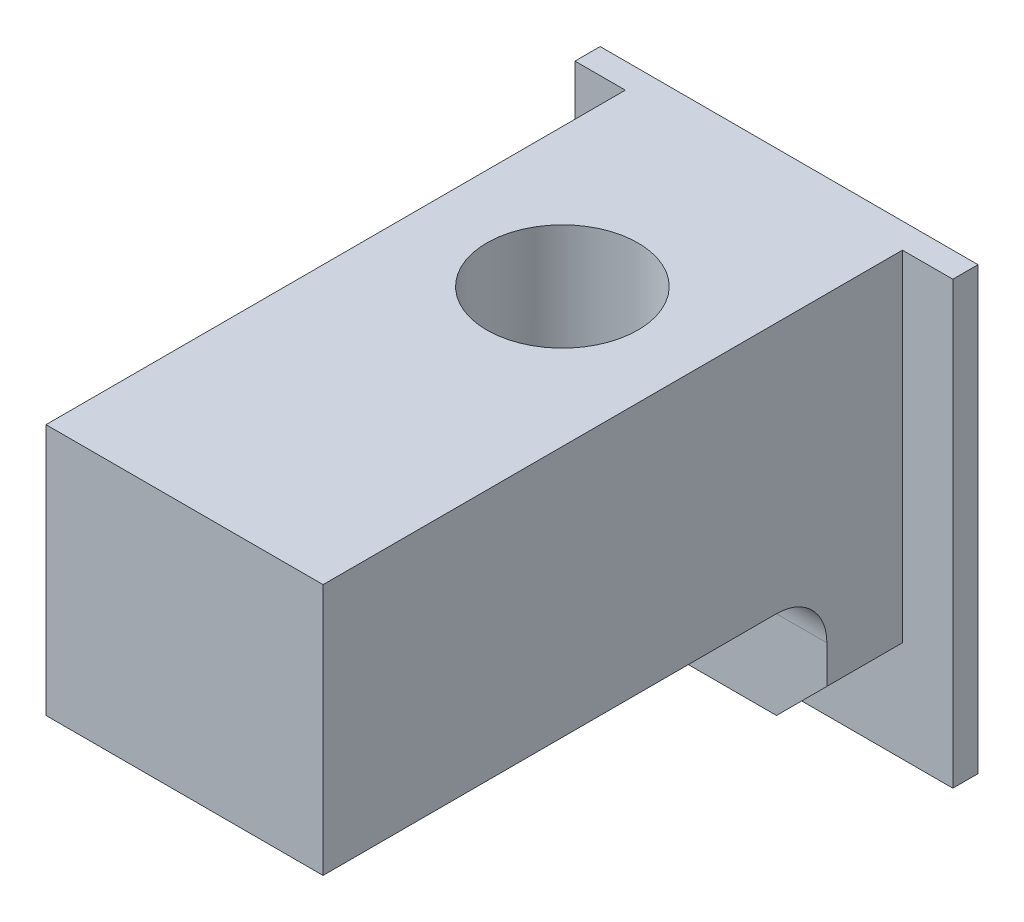
ISO-10303-21;
HEADER;
FILE_DESCRIPTION(('STEP AP214'),'2;1');
FILE_NAME('part.step','',(''),(''),'','','');
FILE_SCHEMA(('AUTOMOTIVE_DESIGN { 1 0 10303 214 1 1 1 1 }'));
ENDSEC;
DATA;
#1=APPLICATION_CONTEXT('core data for automotive mechanical design processes');
#2=APPLICATION_PROTOCOL_DEFINITION('international standard','automotive_design',2000,#1);
#3=PRODUCT_CONTEXT('',#1,'mechanical');
#4=PRODUCT('Part','Part','',(#3));
#5=PRODUCT_RELATED_PRODUCT_CATEGORY('part','',(#4));
#6=PRODUCT_DEFINITION_FORMATION('','',#4);
#7=PRODUCT_DEFINITION_CONTEXT('part definition',#1,'design');
#8=PRODUCT_DEFINITION('design','',#6,#7);
#9=PRODUCT_DEFINITION_SHAPE('','',#8);
#10=(LENGTH_UNIT() NAMED_UNIT(*) SI_UNIT(.MILLI.,.METRE.));
#11=(NAMED_UNIT(*) PLANE_ANGLE_UNIT() SI_UNIT($,.RADIAN.));
#12=(NAMED_UNIT(*) SI_UNIT($,.STERADIAN.) SOLID_ANGLE_UNIT());
#13=UNCERTAINTY_MEASURE_WITH_UNIT(LENGTH_MEASURE(1.E-05),#10,'distance_accuracy_value','');
#14=(GEOMETRIC_REPRESENTATION_CONTEXT(3) GLOBAL_UNCERTAINTY_ASSIGNED_CONTEXT((#13)) GLOBAL_UNIT_ASSIGNED_CONTEXT((#10,
#11,#12)) REPRESENTATION_CONTEXT('',''));
#15=CARTESIAN_POINT('',(0.,0.,0.));
#16=DIRECTION('',(0.,0.,1.));
#17=DIRECTION('',(1.,0.,0.));
#18=AXIS2_PLACEMENT_3D('',#15,#16,#17);
#19=CARTESIAN_POINT('',(2.75000000000002,-2.5,4.99999999999998));
#20=DIRECTION('',(0.,1.,0.));
#21=DIRECTION('',(-1.,0.,0.));
#22=AXIS2_PLACEMENT_3D('',#19,#20,#21);
#23=PLANE('',#22);
#24=DIRECTION('',(0.,0.,-1.));
#25=VECTOR('',#24,1.);
#26=CARTESIAN_POINT('',(-2.74999999999998,-2.5,5.00000000000003));
#27=LINE('',#26,#25);
#28=CARTESIAN_POINT('',(-2.74999999999998,-2.5,5.00000000000003));
#29=VERTEX_POINT('',#28);
#30=CARTESIAN_POINT('',(-2.75000000000001,-2.5,-4.00000000000006));
#31=VERTEX_POINT('',#30);
#32=EDGE_CURVE('E285',#29,#31,#27,.T.);
#33=ORIENTED_EDGE('',*,*,#32,.T.);
#34=DIRECTION('',(1.,0.,0.));
#35=VECTOR('',#34,1.);
#36=CARTESIAN_POINT('',(2.75000000000005,-2.5,-4.00000000000003));
#37=LINE('',#36,#35);
#38=CARTESIAN_POINT('',(0.,-2.5,-4.));
#39=VERTEX_POINT('',#38);
#40=EDGE_CURVE('E251',#31,#39,#37,.T.);
#41=ORIENTED_EDGE('',*,*,#40,.T.);
#42=CARTESIAN_POINT('',(0.,-2.5,-2.50000000000003));
#43=DIRECTION('',(0.,1.,0.));
#44=DIRECTION('',(0.,0.,1.));
#45=AXIS2_PLACEMENT_3D('',#42,#43,#44);
#46=CIRCLE('',#45,1.5);
#47=EDGE_CURVE('E269',#39,#39,#46,.T.);
#48=ORIENTED_EDGE('',*,*,#47,.T.);
#49=DIRECTION('',(1.,0.,0.));
#50=VECTOR('',#49,1.);
#51=CARTESIAN_POINT('',(2.75000000000005,-2.5,-4.00000000000003));
#52=LINE('',#51,#50);
#53=CARTESIAN_POINT('',(2.75000000000005,-2.5,-4.00000000000003));
#54=VERTEX_POINT('',#53);
#55=EDGE_CURVE('E248',#39,#54,#52,.T.);
#56=ORIENTED_EDGE('',*,*,#55,.T.);
#57=DIRECTION('',(0.,0.,-1.));
#58=VECTOR('',#57,1.);
#59=CARTESIAN_POINT('',(2.75000000000002,-2.5,4.99999999999998));
#60=LINE('',#59,#58);
#61=CARTESIAN_POINT('',(2.75000000000002,-2.5,4.99999999999998));
#62=VERTEX_POINT('',#61);
#63=EDGE_CURVE('E286',#62,#54,#60,.T.);
#64=ORIENTED_EDGE('',*,*,#63,.F.);
#65=DIRECTION('',(1.,0.,0.));
#66=VECTOR('',#65,1.);
#67=CARTESIAN_POINT('',(2.75000000000002,-2.5,4.99999999999998));
#68=LINE('',#67,#66);
#69=EDGE_CURVE('E276',#29,#62,#68,.T.);
#70=ORIENTED_EDGE('',*,*,#69,.F.);
#71=EDGE_LOOP('',(#33,#41,#48,#56,#64,#70));
#72=FACE_BOUND('',#71,.T.);
#73=ADVANCED_FACE('F46',(#72),#23,.F.);
#74=CARTESIAN_POINT('',(2.75000000000002,2.5,4.99999999999998));
#75=DIRECTION('',(-1.,0.,0.));
#76=DIRECTION('',(0.,-1.,0.));
#77=AXIS2_PLACEMENT_3D('',#74,#75,#76);
#78=PLANE('',#77);
#79=ORIENTED_EDGE('',*,*,#63,.T.);
#80=CARTESIAN_POINT('',(2.75000000000005,-3.5,-4.00000000000003));
#81=DIRECTION('',(-1.,0.,0.));
#82=DIRECTION('',(0.,-1.,0.));
#83=AXIS2_PLACEMENT_3D('',#80,#81,#82);
#84=CIRCLE('',#83,1.);
#85=CARTESIAN_POINT('',(2.74999999999999,-3.5,-5.00000000000003));
#86=VERTEX_POINT('',#85);
#87=EDGE_CURVE('E54',#54,#86,#84,.T.);
#88=ORIENTED_EDGE('',*,*,#87,.T.);
#89=DIRECTION('',(0.,-1.,0.));
#90=VECTOR('',#89,1.);
#91=CARTESIAN_POINT('',(2.74999999999999,2.5,-5.00000000000003));
#92=LINE('',#91,#90);
#93=CARTESIAN_POINT('',(2.74999999999999,-4.25,-5.00000000000003));
#94=VERTEX_POINT('',#93);
#95=EDGE_CURVE('E172',#86,#94,#92,.T.);
#96=ORIENTED_EDGE('',*,*,#95,.T.);
#97=DIRECTION('',(0.,0.,-1.));
#98=VECTOR('',#97,1.);
#99=CARTESIAN_POINT('',(2.75000000000002,-4.25,4.99999999999998));
#100=LINE('',#99,#98);
#101=CARTESIAN_POINT('',(2.75000000000001,-4.25,-6.50000000000009));
#102=VERTEX_POINT('',#101);
#103=EDGE_CURVE('E243',#94,#102,#100,.T.);
#104=ORIENTED_EDGE('',*,*,#103,.T.);
#105=DIRECTION('',(0.,-1.,0.));
#106=VECTOR('',#105,1.);
#107=CARTESIAN_POINT('',(2.75000000000002,2.5,-6.50000000000003));
#108=LINE('',#107,#106);
#109=CARTESIAN_POINT('',(2.75000000000002,2.5,-6.50000000000003));
#110=VERTEX_POINT('',#109);
#111=EDGE_CURVE('E298',#110,#102,#108,.T.);
#112=ORIENTED_EDGE('',*,*,#111,.F.);
#113=DIRECTION('',(0.,0.,-1.));
#114=VECTOR('',#113,1.);
#115=CARTESIAN_POINT('',(2.75000000000002,2.5,4.99999999999998));
#116=LINE('',#115,#114);
#117=CARTESIAN_POINT('',(2.75000000000002,2.5,4.99999999999998));
#118=VERTEX_POINT('',#117);
#119=EDGE_CURVE('E205',#118,#110,#116,.T.);
#120=ORIENTED_EDGE('',*,*,#119,.F.);
#121=DIRECTION('',(0.,1.,0.));
#122=VECTOR('',#121,1.);
#123=CARTESIAN_POINT('',(2.75000000000002,2.5,4.99999999999998));
#124=LINE('',#123,#122);
#125=EDGE_CURVE('E279',#62,#118,#124,.T.);
#126=ORIENTED_EDGE('',*,*,#125,.F.);
#127=EDGE_LOOP('',(#79,#88,#96,#104,#112,#120,#126));
#128=FACE_BOUND('',#127,.T.);
#129=ADVANCED_FACE('F219',(#128),#78,.F.);
#130=CARTESIAN_POINT('',(-2.74999999999998,2.5,5.00000000000003));
#131=DIRECTION('',(0.,-1.,0.));
#132=DIRECTION('',(0.,0.,-1.));
#133=AXIS2_PLACEMENT_3D('',#130,#131,#132);
#134=PLANE('',#133);
#135=CARTESIAN_POINT('',(0.,2.5,-2.50000000000003));
#136=DIRECTION('',(0.,1.,0.));
#137=DIRECTION('',(0.,0.,1.));
#138=AXIS2_PLACEMENT_3D('',#135,#136,#137);
#139=CIRCLE('',#138,1.5);
#140=CARTESIAN_POINT('',(0.,2.5,-1.00000000000003));
#141=VERTEX_POINT('',#140);
#142=EDGE_CURVE('E272',#141,#141,#139,.T.);
#143=ORIENTED_EDGE('',*,*,#142,.F.);
#144=EDGE_LOOP('',(#143));
#145=FACE_BOUND('',#144,.T.);
#146=ORIENTED_EDGE('',*,*,#119,.T.);
#147=DIRECTION('',(1.,0.,0.));
#148=VECTOR('',#147,1.);
#149=CARTESIAN_POINT('',(-3.75,2.5,-6.50000000000001));
#150=LINE('',#149,#148);
#151=CARTESIAN_POINT('',(3.75000000000002,2.5,-6.50000000000009));
#152=VERTEX_POINT('',#151);
#153=EDGE_CURVE('E182',#110,#152,#150,.T.);
#154=ORIENTED_EDGE('',*,*,#153,.T.);
#155=DIRECTION('',(0.,0.,1.));
#156=VECTOR('',#155,1.);
#157=CARTESIAN_POINT('',(3.74999999999997,2.5,-7.00000000000001));
#158=LINE('',#157,#156);
#159=CARTESIAN_POINT('',(3.74999999999997,2.5,-7.00000000000001));
#160=VERTEX_POINT('',#159);
#161=EDGE_CURVE('E152',#160,#152,#158,.T.);
#162=ORIENTED_EDGE('',*,*,#161,.F.);
#163=DIRECTION('',(1.,0.,0.));
#164=VECTOR('',#163,1.);
#165=CARTESIAN_POINT('',(-3.75000000000001,2.5,-6.99999999999998));
#166=LINE('',#165,#164);
#167=CARTESIAN_POINT('',(-3.75000000000001,2.5,-6.99999999999998));
#168=VERTEX_POINT('',#167);
#169=EDGE_CURVE('E144',#168,#160,#166,.T.);
#170=ORIENTED_EDGE('',*,*,#169,.F.);
#171=DIRECTION('',(0.,0.,1.));
#172=VECTOR('',#171,1.);
#173=CARTESIAN_POINT('',(-3.75000000000001,2.5,-6.99999999999998));
#174=LINE('',#173,#172);
#175=CARTESIAN_POINT('',(-3.75,2.5,-6.50000000000001));
#176=VERTEX_POINT('',#175);
#177=EDGE_CURVE('E149',#168,#176,#174,.T.);
#178=ORIENTED_EDGE('',*,*,#177,.T.);
#179=CARTESIAN_POINT('',(-2.75,2.5,-6.50000000000009));
#180=VERTEX_POINT('',#179);
#181=EDGE_CURVE('E178',#176,#180,#150,.T.);
#182=ORIENTED_EDGE('',*,*,#181,.T.);
#183=DIRECTION('',(0.,0.,-1.));
#184=VECTOR('',#183,1.);
#185=CARTESIAN_POINT('',(-2.74999999999998,2.5,5.00000000000003));
#186=LINE('',#185,#184);
#187=CARTESIAN_POINT('',(-2.74999999999998,2.5,5.00000000000003));
#188=VERTEX_POINT('',#187);
#189=EDGE_CURVE('E292',#188,#180,#186,.T.);
#190=ORIENTED_EDGE('',*,*,#189,.F.);
#191=DIRECTION('',(-1.,0.,0.));
#192=VECTOR('',#191,1.);
#193=CARTESIAN_POINT('',(-2.74999999999998,2.5,5.00000000000003));
#194=LINE('',#193,#192);
#195=EDGE_CURVE('E281',#118,#188,#194,.T.);
#196=ORIENTED_EDGE('',*,*,#195,.F.);
#197=EDGE_LOOP('',(#146,#154,#162,#170,#178,#182,#190,#196));
#198=FACE_BOUND('',#197,.T.);
#199=ADVANCED_FACE('F146',(#145,#198),#134,.F.);
#200=CARTESIAN_POINT('',(-2.74999999999998,-2.5,5.00000000000003));
#201=DIRECTION('',(1.,0.,0.));
#202=DIRECTION('',(0.,1.,0.));
#203=AXIS2_PLACEMENT_3D('',#200,#201,#202);
#204=PLANE('',#203);
#205=DIRECTION('',(0.,1.,0.));
#206=VECTOR('',#205,1.);
#207=CARTESIAN_POINT('',(-2.75,2.5,-6.50000000000009));
#208=LINE('',#207,#206);
#209=CARTESIAN_POINT('',(-2.75,-4.25,-6.50000000000009));
#210=VERTEX_POINT('',#209);
#211=EDGE_CURVE('E268',#210,#180,#208,.T.);
#212=ORIENTED_EDGE('',*,*,#211,.F.);
#213=DIRECTION('',(0.,0.,1.));
#214=VECTOR('',#213,1.);
#215=CARTESIAN_POINT('',(-2.74999999999998,-4.25,5.00000000000003));
#216=LINE('',#215,#214);
#217=CARTESIAN_POINT('',(-2.75000000000004,-4.25,-5.00000000000009));
#218=VERTEX_POINT('',#217);
#219=EDGE_CURVE('E288',#210,#218,#216,.T.);
#220=ORIENTED_EDGE('',*,*,#219,.T.);
#221=DIRECTION('',(0.,1.,0.));
#222=VECTOR('',#221,1.);
#223=CARTESIAN_POINT('',(-2.75000000000003,2.5,-5.00000000000006));
#224=LINE('',#223,#222);
#225=CARTESIAN_POINT('',(-2.75000000000004,-3.5,-5.00000000000009));
#226=VERTEX_POINT('',#225);
#227=EDGE_CURVE('E170',#218,#226,#224,.T.);
#228=ORIENTED_EDGE('',*,*,#227,.T.);
#229=CARTESIAN_POINT('',(-2.75000000000001,-3.5,-4.00000000000006));
#230=DIRECTION('',(1.,0.,0.));
#231=DIRECTION('',(0.,1.,0.));
#232=AXIS2_PLACEMENT_3D('',#229,#230,#231);
#233=CIRCLE('',#232,1.);
#234=EDGE_CURVE('E12',#226,#31,#233,.T.);
#235=ORIENTED_EDGE('',*,*,#234,.T.);
#236=ORIENTED_EDGE('',*,*,#32,.F.);
#237=DIRECTION('',(0.,-1.,0.));
#238=VECTOR('',#237,1.);
#239=CARTESIAN_POINT('',(-2.74999999999998,-2.5,5.00000000000003));
#240=LINE('',#239,#238);
#241=EDGE_CURVE('E283',#188,#29,#240,.T.);
#242=ORIENTED_EDGE('',*,*,#241,.F.);
#243=ORIENTED_EDGE('',*,*,#189,.T.);
#244=EDGE_LOOP('',(#212,#220,#228,#235,#236,#242,#243));
#245=FACE_BOUND('',#244,.T.);
#246=ADVANCED_FACE('F339',(#245),#204,.F.);
#247=CARTESIAN_POINT('',(2.75000000000002,-2.5,4.99999999999998));
#248=DIRECTION('',(0.,0.,1.));
#249=DIRECTION('',(1.,0.,0.));
#250=AXIS2_PLACEMENT_3D('',#247,#248,#249);
#251=PLANE('',#250);
#252=ORIENTED_EDGE('',*,*,#69,.T.);
#253=ORIENTED_EDGE('',*,*,#125,.T.);
#254=ORIENTED_EDGE('',*,*,#195,.T.);
#255=ORIENTED_EDGE('',*,*,#241,.T.);
#256=EDGE_LOOP('',(#252,#253,#254,#255));
#257=FACE_BOUND('',#256,.T.);
#258=ADVANCED_FACE('F335',(#257),#251,.T.);
#259=CARTESIAN_POINT('',(0.,2.5,-2.50000000000003));
#260=DIRECTION('',(0.,1.,0.));
#261=DIRECTION('',(0.,0.,1.));
#262=AXIS2_PLACEMENT_3D('',#259,#260,#261);
#263=CYLINDRICAL_SURFACE('',#262,1.5);
#264=ORIENTED_EDGE('',*,*,#47,.F.);
#265=EDGE_LOOP('',(#264));
#266=FACE_BOUND('',#265,.T.);
#267=ORIENTED_EDGE('',*,*,#142,.T.);
#268=EDGE_LOOP('',(#267));
#269=FACE_BOUND('',#268,.T.);
#270=ADVANCED_FACE('F330',(#266,#269),#263,.F.);
#271=CARTESIAN_POINT('',(-2.75000000000004,-5.25,-5.00000000000009));
#272=DIRECTION('',(0.,0.,1.));
#273=DIRECTION('',(1.,0.,0.));
#274=AXIS2_PLACEMENT_3D('',#271,#272,#273);
#275=PLANE('',#274);
#276=ORIENTED_EDGE('',*,*,#95,.F.);
#277=DIRECTION('',(1.,0.,0.));
#278=VECTOR('',#277,1.);
#279=CARTESIAN_POINT('',(-2.75000000000004,-3.5,-5.00000000000009));
#280=LINE('',#279,#278);
#281=EDGE_CURVE('E67',#86,#226,#280,.F.);
#282=ORIENTED_EDGE('',*,*,#281,.T.);
#283=ORIENTED_EDGE('',*,*,#227,.F.);
#284=DIRECTION('',(-0.707106781186549,0.707106781186546,0.));
#285=VECTOR('',#284,1.);
#286=CARTESIAN_POINT('',(-2.25,-4.75,-5.00000000000003));
#287=LINE('',#286,#285);
#288=CARTESIAN_POINT('',(-1.75000000000001,-5.25,-5.));
#289=VERTEX_POINT('',#288);
#290=EDGE_CURVE('E315',#218,#289,#287,.F.);
#291=ORIENTED_EDGE('',*,*,#290,.T.);
#292=DIRECTION('',(-1.,0.,0.));
#293=VECTOR('',#292,1.);
#294=CARTESIAN_POINT('',(-2.75000000000004,-5.25,-5.00000000000009));
#295=LINE('',#294,#293);
#296=CARTESIAN_POINT('',(1.74999999999998,-5.25,-5.00000000000003));
#297=VERTEX_POINT('',#296);
#298=EDGE_CURVE('E260',#297,#289,#295,.T.);
#299=ORIENTED_EDGE('',*,*,#298,.F.);
#300=DIRECTION('',(-0.707106781186547,-0.707106781186549,0.));
#301=VECTOR('',#300,1.);
#302=CARTESIAN_POINT('',(-0.499999999999968,-7.50000000000001,-5.00000000000014));
#303=LINE('',#302,#301);
#304=EDGE_CURVE('E317',#297,#94,#303,.F.);
#305=ORIENTED_EDGE('',*,*,#304,.T.);
#306=EDGE_LOOP('',(#276,#282,#283,#291,#299,#305));
#307=FACE_BOUND('',#306,.T.);
#308=ADVANCED_FACE('F324',(#307),#275,.T.);
#309=CARTESIAN_POINT('',(-2.75,-5.25,-6.50000000000009));
#310=DIRECTION('',(0.,1.,0.));
#311=DIRECTION('',(-1.,0.,0.));
#312=AXIS2_PLACEMENT_3D('',#309,#310,#311);
#313=PLANE('',#312);
#314=ORIENTED_EDGE('',*,*,#298,.T.);
#315=DIRECTION('',(0.,0.,-1.));
#316=VECTOR('',#315,1.);
#317=CARTESIAN_POINT('',(-1.75000000000001,-5.25,-6.50000000000003));
#318=LINE('',#317,#316);
#319=CARTESIAN_POINT('',(-1.75000000000001,-5.25,-6.50000000000003));
#320=VERTEX_POINT('',#319);
#321=EDGE_CURVE('E313',#289,#320,#318,.T.);
#322=ORIENTED_EDGE('',*,*,#321,.T.);
#323=DIRECTION('',(-1.,0.,0.));
#324=VECTOR('',#323,1.);
#325=CARTESIAN_POINT('',(-2.75,-5.25,-6.50000000000009));
#326=LINE('',#325,#324);
#327=CARTESIAN_POINT('',(1.74999999999999,-5.25,-6.50000000000009));
#328=VERTEX_POINT('',#327);
#329=EDGE_CURVE('E273',#328,#320,#326,.T.);
#330=ORIENTED_EDGE('',*,*,#329,.F.);
#331=DIRECTION('',(0.,0.,1.));
#332=VECTOR('',#331,1.);
#333=CARTESIAN_POINT('',(1.74999999999999,-5.25,-6.50000000000009));
#334=LINE('',#333,#332);
#335=EDGE_CURVE('E245',#328,#297,#334,.T.);
#336=ORIENTED_EDGE('',*,*,#335,.T.);
#337=EDGE_LOOP('',(#314,#322,#330,#336));
#338=FACE_BOUND('',#337,.T.);
#339=ADVANCED_FACE('F216',(#338),#313,.F.);
#340=CARTESIAN_POINT('',(-3.75000000000001,2.5,-6.99999999999998));
#341=DIRECTION('',(1.,0.,0.));
#342=DIRECTION('',(0.,1.,0.));
#343=AXIS2_PLACEMENT_3D('',#340,#341,#342);
#344=PLANE('',#343);
#345=DIRECTION('',(0.,1.,0.));
#346=VECTOR('',#345,1.);
#347=CARTESIAN_POINT('',(-3.75,2.5,-6.50000000000001));
#348=LINE('',#347,#346);
#349=CARTESIAN_POINT('',(-3.75,-6.25000000000001,-6.50000000000001));
#350=VERTEX_POINT('',#349);
#351=EDGE_CURVE('E169',#350,#176,#348,.T.);
#352=ORIENTED_EDGE('',*,*,#351,.T.);
#353=ORIENTED_EDGE('',*,*,#177,.F.);
#354=DIRECTION('',(0.,1.,0.));
#355=VECTOR('',#354,1.);
#356=CARTESIAN_POINT('',(-3.75000000000001,2.5,-6.99999999999998));
#357=LINE('',#356,#355);
#358=CARTESIAN_POINT('',(-3.75000000000001,-6.25000000000001,-6.99999999999998));
#359=VERTEX_POINT('',#358);
#360=EDGE_CURVE('E156',#359,#168,#357,.T.);
#361=ORIENTED_EDGE('',*,*,#360,.F.);
#362=DIRECTION('',(0.,0.,1.));
#363=VECTOR('',#362,1.);
#364=CARTESIAN_POINT('',(-3.75000000000001,-6.25000000000001,-6.99999999999998));
#365=LINE('',#364,#363);
#366=EDGE_CURVE('E191',#359,#350,#365,.T.);
#367=ORIENTED_EDGE('',*,*,#366,.T.);
#368=EDGE_LOOP('',(#352,#353,#361,#367));
#369=FACE_BOUND('',#368,.T.);
#370=ADVANCED_FACE('F167',(#369),#344,.F.);
#371=CARTESIAN_POINT('',(3.74999999999997,2.5,-7.00000000000001));
#372=DIRECTION('',(-1.,0.,0.));
#373=DIRECTION('',(0.,-1.,0.));
#374=AXIS2_PLACEMENT_3D('',#371,#372,#373);
#375=PLANE('',#374);
#376=DIRECTION('',(0.,-1.,0.));
#377=VECTOR('',#376,1.);
#378=CARTESIAN_POINT('',(3.75000000000002,2.5,-6.50000000000009));
#379=LINE('',#378,#377);
#380=CARTESIAN_POINT('',(3.75000000000002,-6.25000000000001,-6.50000000000009));
#381=VERTEX_POINT('',#380);
#382=EDGE_CURVE('E181',#152,#381,#379,.T.);
#383=ORIENTED_EDGE('',*,*,#382,.T.);
#384=DIRECTION('',(0.,0.,1.));
#385=VECTOR('',#384,1.);
#386=CARTESIAN_POINT('',(3.74999999999997,-6.25000000000001,-7.00000000000001));
#387=LINE('',#386,#385);
#388=CARTESIAN_POINT('',(3.74999999999997,-6.25000000000001,-7.00000000000001));
#389=VERTEX_POINT('',#388);
#390=EDGE_CURVE('E174',#389,#381,#387,.T.);
#391=ORIENTED_EDGE('',*,*,#390,.F.);
#392=DIRECTION('',(0.,-1.,0.));
#393=VECTOR('',#392,1.);
#394=CARTESIAN_POINT('',(3.74999999999997,2.5,-7.00000000000001));
#395=LINE('',#394,#393);
#396=EDGE_CURVE('E155',#160,#389,#395,.T.);
#397=ORIENTED_EDGE('',*,*,#396,.F.);
#398=ORIENTED_EDGE('',*,*,#161,.T.);
#399=EDGE_LOOP('',(#383,#391,#397,#398));
#400=FACE_BOUND('',#399,.T.);
#401=ADVANCED_FACE('F207',(#400),#375,.F.);
#402=CARTESIAN_POINT('',(-3.75000000000001,-6.25000000000001,-6.99999999999998));
#403=DIRECTION('',(0.,1.,0.));
#404=DIRECTION('',(-1.,0.,0.));
#405=AXIS2_PLACEMENT_3D('',#402,#403,#404);
#406=PLANE('',#405);
#407=DIRECTION('',(-1.,0.,0.));
#408=VECTOR('',#407,1.);
#409=CARTESIAN_POINT('',(-3.75,-6.25000000000001,-6.50000000000001));
#410=LINE('',#409,#408);
#411=EDGE_CURVE('E165',#381,#350,#410,.T.);
#412=ORIENTED_EDGE('',*,*,#411,.T.);
#413=ORIENTED_EDGE('',*,*,#366,.F.);
#414=DIRECTION('',(-1.,0.,0.));
#415=VECTOR('',#414,1.);
#416=CARTESIAN_POINT('',(-3.75000000000001,-6.25000000000001,-6.99999999999998));
#417=LINE('',#416,#415);
#418=EDGE_CURVE('E161',#389,#359,#417,.T.);
#419=ORIENTED_EDGE('',*,*,#418,.F.);
#420=ORIENTED_EDGE('',*,*,#390,.T.);
#421=EDGE_LOOP('',(#412,#413,#419,#420));
#422=FACE_BOUND('',#421,.T.);
#423=ADVANCED_FACE('F196',(#422),#406,.F.);
#424=CARTESIAN_POINT('',(-3.75000000000001,-6.25000000000001,-6.99999999999998));
#425=DIRECTION('',(0.,0.,1.));
#426=DIRECTION('',(1.,0.,0.));
#427=AXIS2_PLACEMENT_3D('',#424,#425,#426);
#428=PLANE('',#427);
#429=ORIENTED_EDGE('',*,*,#360,.T.);
#430=ORIENTED_EDGE('',*,*,#169,.T.);
#431=ORIENTED_EDGE('',*,*,#396,.T.);
#432=ORIENTED_EDGE('',*,*,#418,.T.);
#433=EDGE_LOOP('',(#429,#430,#431,#432));
#434=FACE_BOUND('',#433,.T.);
#435=ADVANCED_FACE('F159',(#434),#428,.F.);
#436=CARTESIAN_POINT('',(-3.75,-6.25000000000001,-6.50000000000001));
#437=DIRECTION('',(0.,0.,1.));
#438=DIRECTION('',(1.,0.,0.));
#439=AXIS2_PLACEMENT_3D('',#436,#437,#438);
#440=PLANE('',#439);
#441=ORIENTED_EDGE('',*,*,#111,.T.);
#442=DIRECTION('',(0.707106781186547,0.707106781186549,0.));
#443=VECTOR('',#442,1.);
#444=CARTESIAN_POINT('',(1.74999999999999,-5.25,-6.50000000000009));
#445=LINE('',#444,#443);
#446=EDGE_CURVE('E242',#102,#328,#445,.F.);
#447=ORIENTED_EDGE('',*,*,#446,.T.);
#448=ORIENTED_EDGE('',*,*,#329,.T.);
#449=DIRECTION('',(0.707106781186549,-0.707106781186546,0.));
#450=VECTOR('',#449,1.);
#451=CARTESIAN_POINT('',(-2.75,-4.25,-6.50000000000009));
#452=LINE('',#451,#450);
#453=EDGE_CURVE('E249',#320,#210,#452,.F.);
#454=ORIENTED_EDGE('',*,*,#453,.T.);
#455=ORIENTED_EDGE('',*,*,#211,.T.);
#456=ORIENTED_EDGE('',*,*,#181,.F.);
#457=ORIENTED_EDGE('',*,*,#351,.F.);
#458=ORIENTED_EDGE('',*,*,#411,.F.);
#459=ORIENTED_EDGE('',*,*,#382,.F.);
#460=ORIENTED_EDGE('',*,*,#153,.F.);
#461=EDGE_LOOP('',(#441,#447,#448,#454,#455,#456,#457,#458,#459,#460));
#462=FACE_BOUND('',#461,.T.);
#463=ADVANCED_FACE('F201',(#462),#440,.T.);
#464=CARTESIAN_POINT('',(-2.74999999999998,-4.25,5.00000000000003));
#465=DIRECTION('',(0.707106781186548,0.707106781186549,0.));
#466=DIRECTION('',(-0.707106781186549,0.707106781186546,0.));
#467=AXIS2_PLACEMENT_3D('',#464,#465,#466);
#468=PLANE('',#467);
#469=ORIENTED_EDGE('',*,*,#453,.F.);
#470=ORIENTED_EDGE('',*,*,#321,.F.);
#471=ORIENTED_EDGE('',*,*,#290,.F.);
#472=ORIENTED_EDGE('',*,*,#219,.F.);
#473=EDGE_LOOP('',(#469,#470,#471,#472));
#474=FACE_BOUND('',#473,.T.);
#475=ADVANCED_FACE('F229',(#474),#468,.F.);
#476=CARTESIAN_POINT('',(1.74999999999999,-5.25,-6.50000000000009));
#477=DIRECTION('',(-0.70710678118655,0.707106781186546,0.));
#478=DIRECTION('',(-0.707106781186547,-0.707106781186549,0.));
#479=AXIS2_PLACEMENT_3D('',#476,#477,#478);
#480=PLANE('',#479);
#481=ORIENTED_EDGE('',*,*,#446,.F.);
#482=ORIENTED_EDGE('',*,*,#103,.F.);
#483=ORIENTED_EDGE('',*,*,#304,.F.);
#484=ORIENTED_EDGE('',*,*,#335,.F.);
#485=EDGE_LOOP('',(#481,#482,#483,#484));
#486=FACE_BOUND('',#485,.T.);
#487=ADVANCED_FACE('F231',(#486),#480,.F.);
#488=CARTESIAN_POINT('',(2.75000000000005,-3.5,-4.00000000000003));
#489=DIRECTION('',(1.,0.,0.));
#490=DIRECTION('',(0.,1.,0.));
#491=AXIS2_PLACEMENT_3D('',#488,#489,#490);
#492=CYLINDRICAL_SURFACE('',#491,1.);
#493=ORIENTED_EDGE('',*,*,#234,.F.);
#494=ORIENTED_EDGE('',*,*,#281,.F.);
#495=ORIENTED_EDGE('',*,*,#87,.F.);
#496=ORIENTED_EDGE('',*,*,#55,.F.);
#497=ORIENTED_EDGE('',*,*,#40,.F.);
#498=EDGE_LOOP('',(#493,#494,#495,#496,#497));
#499=FACE_BOUND('',#498,.T.);
#500=ADVANCED_FACE('F48',(#499),#492,.F.);
#501=CLOSED_SHELL('',(#73,#129,#199,#246,#258,#270,#308,#339,#370,#401,#423,#435,#463,#475,#487,#500));
#502=MANIFOLD_SOLID_BREP('B2',#501);
#503=ADVANCED_BREP_SHAPE_REPRESENTATION('',(#18,#502),#14);
#504=SHAPE_DEFINITION_REPRESENTATION(#9,#503);
ENDSEC;
END-ISO-10303-21;
